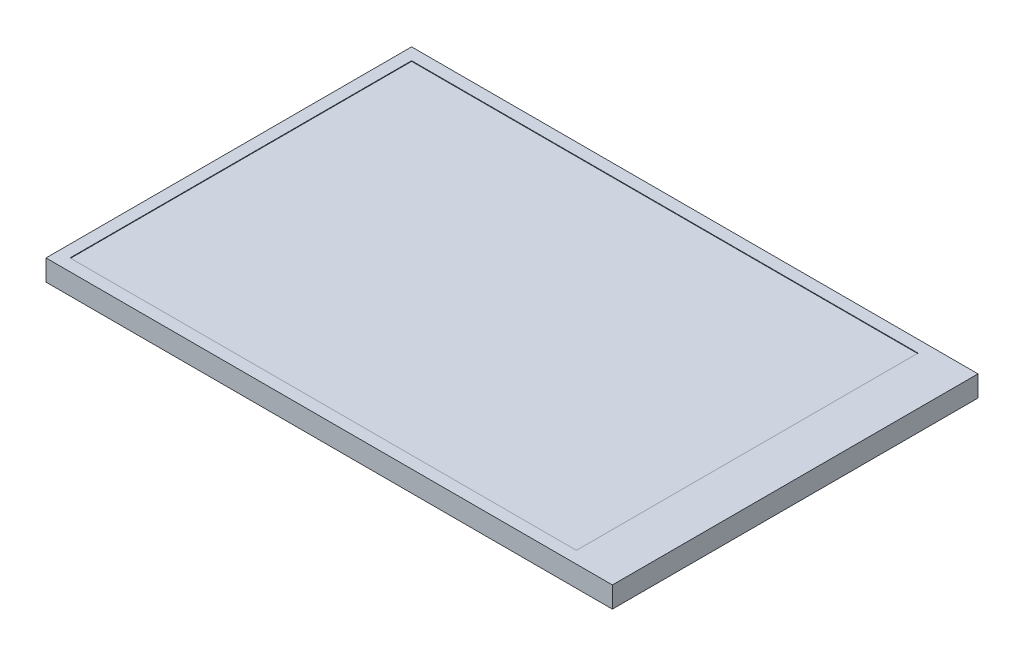
ISO-10303-21;
HEADER;
FILE_DESCRIPTION(('STEP AP214'),'2;1');
FILE_NAME('part.step','',(''),(''),'','','');
FILE_SCHEMA(('AUTOMOTIVE_DESIGN { 1 0 10303 214 1 1 1 1 }'));
ENDSEC;
DATA;
#1=APPLICATION_CONTEXT('core data for automotive mechanical design processes');
#2=APPLICATION_PROTOCOL_DEFINITION('international standard','automotive_design',2000,#1);
#3=PRODUCT_CONTEXT('',#1,'mechanical');
#4=PRODUCT('Part','Part','',(#3));
#5=PRODUCT_RELATED_PRODUCT_CATEGORY('part','',(#4));
#6=PRODUCT_DEFINITION_FORMATION('','',#4);
#7=PRODUCT_DEFINITION_CONTEXT('part definition',#1,'design');
#8=PRODUCT_DEFINITION('design','',#6,#7);
#9=PRODUCT_DEFINITION_SHAPE('','',#8);
#10=(LENGTH_UNIT() NAMED_UNIT(*) SI_UNIT(.MILLI.,.METRE.));
#11=(NAMED_UNIT(*) PLANE_ANGLE_UNIT() SI_UNIT($,.RADIAN.));
#12=(NAMED_UNIT(*) SI_UNIT($,.STERADIAN.) SOLID_ANGLE_UNIT());
#13=UNCERTAINTY_MEASURE_WITH_UNIT(LENGTH_MEASURE(1.E-05),#10,'distance_accuracy_value','');
#14=(GEOMETRIC_REPRESENTATION_CONTEXT(3) GLOBAL_UNCERTAINTY_ASSIGNED_CONTEXT((#13)) GLOBAL_UNIT_ASSIGNED_CONTEXT((#10,
#11,#12)) REPRESENTATION_CONTEXT('',''));
#15=CARTESIAN_POINT('',(0.,0.,0.));
#16=DIRECTION('',(0.,0.,1.));
#17=DIRECTION('',(1.,0.,0.));
#18=AXIS2_PLACEMENT_3D('',#15,#16,#17);
#19=CARTESIAN_POINT('',(47.25,3.5,-30.5));
#20=DIRECTION('',(-1.,0.,0.));
#21=DIRECTION('',(0.,0.,1.));
#22=AXIS2_PLACEMENT_3D('',#19,#20,#21);
#23=PLANE('',#22);
#24=DIRECTION('',(0.,0.,-1.));
#25=VECTOR('',#24,1.);
#26=CARTESIAN_POINT('',(47.25,0.,-30.5));
#27=LINE('',#26,#25);
#28=CARTESIAN_POINT('',(47.25,0.,30.5));
#29=VERTEX_POINT('',#28);
#30=CARTESIAN_POINT('',(47.25,0.,-30.5));
#31=VERTEX_POINT('',#30);
#32=EDGE_CURVE('E140',#29,#31,#27,.T.);
#33=ORIENTED_EDGE('',*,*,#32,.T.);
#34=DIRECTION('',(0.,-1.,0.));
#35=VECTOR('',#34,1.);
#36=CARTESIAN_POINT('',(47.25,3.5,-30.5));
#37=LINE('',#36,#35);
#38=CARTESIAN_POINT('',(47.25,3.5,-30.5));
#39=VERTEX_POINT('',#38);
#40=EDGE_CURVE('E11',#39,#31,#37,.T.);
#41=ORIENTED_EDGE('',*,*,#40,.F.);
#42=DIRECTION('',(0.,0.,-1.));
#43=VECTOR('',#42,1.);
#44=CARTESIAN_POINT('',(47.25,3.5,-30.5));
#45=LINE('',#44,#43);
#46=CARTESIAN_POINT('',(47.25,3.5,30.5));
#47=VERTEX_POINT('',#46);
#48=EDGE_CURVE('E144',#47,#39,#45,.T.);
#49=ORIENTED_EDGE('',*,*,#48,.F.);
#50=DIRECTION('',(0.,-1.,0.));
#51=VECTOR('',#50,1.);
#52=CARTESIAN_POINT('',(47.25,3.5,30.5));
#53=LINE('',#52,#51);
#54=EDGE_CURVE('E150',#47,#29,#53,.T.);
#55=ORIENTED_EDGE('',*,*,#54,.T.);
#56=EDGE_LOOP('',(#33,#41,#49,#55));
#57=FACE_BOUND('',#56,.T.);
#58=ADVANCED_FACE('F32',(#57),#23,.F.);
#59=CARTESIAN_POINT('',(-47.25,3.5,-30.5));
#60=DIRECTION('',(0.,0.,1.));
#61=DIRECTION('',(1.,0.,0.));
#62=AXIS2_PLACEMENT_3D('',#59,#60,#61);
#63=PLANE('',#62);
#64=DIRECTION('',(-1.,0.,0.));
#65=VECTOR('',#64,1.);
#66=CARTESIAN_POINT('',(-47.25,0.,-30.5));
#67=LINE('',#66,#65);
#68=CARTESIAN_POINT('',(-47.25,0.,-30.5));
#69=VERTEX_POINT('',#68);
#70=EDGE_CURVE('E153',#31,#69,#67,.T.);
#71=ORIENTED_EDGE('',*,*,#70,.T.);
#72=DIRECTION('',(0.,-1.,0.));
#73=VECTOR('',#72,1.);
#74=CARTESIAN_POINT('',(-47.25,3.5,-30.5));
#75=LINE('',#74,#73);
#76=CARTESIAN_POINT('',(-47.25,3.5,-30.5));
#77=VERTEX_POINT('',#76);
#78=EDGE_CURVE('E39',#77,#69,#75,.T.);
#79=ORIENTED_EDGE('',*,*,#78,.F.);
#80=DIRECTION('',(-1.,0.,0.));
#81=VECTOR('',#80,1.);
#82=CARTESIAN_POINT('',(-47.25,3.5,-30.5));
#83=LINE('',#82,#81);
#84=EDGE_CURVE('E83',#39,#77,#83,.T.);
#85=ORIENTED_EDGE('',*,*,#84,.F.);
#86=ORIENTED_EDGE('',*,*,#40,.T.);
#87=EDGE_LOOP('',(#71,#79,#85,#86));
#88=FACE_BOUND('',#87,.T.);
#89=ADVANCED_FACE('F182',(#88),#63,.F.);
#90=CARTESIAN_POINT('',(-47.25,3.5,-30.5));
#91=DIRECTION('',(1.,0.,0.));
#92=DIRECTION('',(0.,0.,-1.));
#93=AXIS2_PLACEMENT_3D('',#90,#91,#92);
#94=PLANE('',#93);
#95=DIRECTION('',(0.,0.,1.));
#96=VECTOR('',#95,1.);
#97=CARTESIAN_POINT('',(-47.25,0.,-30.5));
#98=LINE('',#97,#96);
#99=CARTESIAN_POINT('',(-47.25,0.,30.5));
#100=VERTEX_POINT('',#99);
#101=EDGE_CURVE('E155',#69,#100,#98,.T.);
#102=ORIENTED_EDGE('',*,*,#101,.T.);
#103=DIRECTION('',(0.,-1.,0.));
#104=VECTOR('',#103,1.);
#105=CARTESIAN_POINT('',(-47.25,3.5,30.5));
#106=LINE('',#105,#104);
#107=CARTESIAN_POINT('',(-47.25,3.5,30.5));
#108=VERTEX_POINT('',#107);
#109=EDGE_CURVE('E159',#108,#100,#106,.T.);
#110=ORIENTED_EDGE('',*,*,#109,.F.);
#111=DIRECTION('',(0.,0.,1.));
#112=VECTOR('',#111,1.);
#113=CARTESIAN_POINT('',(-47.25,3.5,-30.5));
#114=LINE('',#113,#112);
#115=EDGE_CURVE('E147',#77,#108,#114,.T.);
#116=ORIENTED_EDGE('',*,*,#115,.F.);
#117=ORIENTED_EDGE('',*,*,#78,.T.);
#118=EDGE_LOOP('',(#102,#110,#116,#117));
#119=FACE_BOUND('',#118,.T.);
#120=ADVANCED_FACE('F164',(#119),#94,.F.);
#121=CARTESIAN_POINT('',(-47.25,3.5,30.5));
#122=DIRECTION('',(0.,0.,-1.));
#123=DIRECTION('',(-1.,0.,0.));
#124=AXIS2_PLACEMENT_3D('',#121,#122,#123);
#125=PLANE('',#124);
#126=DIRECTION('',(1.,0.,0.));
#127=VECTOR('',#126,1.);
#128=CARTESIAN_POINT('',(-47.25,0.,30.5));
#129=LINE('',#128,#127);
#130=EDGE_CURVE('E76',#100,#29,#129,.T.);
#131=ORIENTED_EDGE('',*,*,#130,.T.);
#132=ORIENTED_EDGE('',*,*,#54,.F.);
#133=DIRECTION('',(1.,0.,0.));
#134=VECTOR('',#133,1.);
#135=CARTESIAN_POINT('',(-47.25,3.5,30.5));
#136=LINE('',#135,#134);
#137=EDGE_CURVE('E55',#108,#47,#136,.T.);
#138=ORIENTED_EDGE('',*,*,#137,.F.);
#139=ORIENTED_EDGE('',*,*,#109,.T.);
#140=EDGE_LOOP('',(#131,#132,#138,#139));
#141=FACE_BOUND('',#140,.T.);
#142=ADVANCED_FACE('F172',(#141),#125,.F.);
#143=CARTESIAN_POINT('',(0.,3.5,0.));
#144=DIRECTION('',(0.,1.,0.));
#145=DIRECTION('',(0.,0.,1.));
#146=AXIS2_PLACEMENT_3D('',#143,#144,#145);
#147=PLANE('',#146);
#148=DIRECTION('',(0.,0.,-1.));
#149=VECTOR('',#148,1.);
#150=CARTESIAN_POINT('',(39.25,3.5,-28.5));
#151=LINE('',#150,#149);
#152=CARTESIAN_POINT('',(39.25,3.5,28.5));
#153=VERTEX_POINT('',#152);
#154=CARTESIAN_POINT('',(39.25,3.5,-28.5));
#155=VERTEX_POINT('',#154);
#156=EDGE_CURVE('E46',#153,#155,#151,.T.);
#157=ORIENTED_EDGE('',*,*,#156,.F.);
#158=DIRECTION('',(1.,0.,0.));
#159=VECTOR('',#158,1.);
#160=CARTESIAN_POINT('',(-45.25,3.5,28.5));
#161=LINE('',#160,#159);
#162=CARTESIAN_POINT('',(-45.25,3.5,28.5));
#163=VERTEX_POINT('',#162);
#164=EDGE_CURVE('E125',#163,#153,#161,.T.);
#165=ORIENTED_EDGE('',*,*,#164,.F.);
#166=DIRECTION('',(0.,0.,1.));
#167=VECTOR('',#166,1.);
#168=CARTESIAN_POINT('',(-45.25,3.5,-28.5));
#169=LINE('',#168,#167);
#170=CARTESIAN_POINT('',(-45.25,3.5,-28.5));
#171=VERTEX_POINT('',#170);
#172=EDGE_CURVE('E128',#171,#163,#169,.T.);
#173=ORIENTED_EDGE('',*,*,#172,.F.);
#174=DIRECTION('',(-1.,0.,0.));
#175=VECTOR('',#174,1.);
#176=CARTESIAN_POINT('',(-45.25,3.5,-28.5));
#177=LINE('',#176,#175);
#178=EDGE_CURVE('E134',#155,#171,#177,.T.);
#179=ORIENTED_EDGE('',*,*,#178,.F.);
#180=EDGE_LOOP('',(#157,#165,#173,#179));
#181=FACE_BOUND('',#180,.T.);
#182=ORIENTED_EDGE('',*,*,#48,.T.);
#183=ORIENTED_EDGE('',*,*,#84,.T.);
#184=ORIENTED_EDGE('',*,*,#115,.T.);
#185=ORIENTED_EDGE('',*,*,#137,.T.);
#186=EDGE_LOOP('',(#182,#183,#184,#185));
#187=FACE_BOUND('',#186,.T.);
#188=ADVANCED_FACE('F174',(#181,#187),#147,.T.);
#189=CARTESIAN_POINT('',(0.,0.,0.));
#190=DIRECTION('',(0.,1.,0.));
#191=DIRECTION('',(0.,0.,1.));
#192=AXIS2_PLACEMENT_3D('',#189,#190,#191);
#193=PLANE('',#192);
#194=ORIENTED_EDGE('',*,*,#32,.F.);
#195=ORIENTED_EDGE('',*,*,#130,.F.);
#196=ORIENTED_EDGE('',*,*,#101,.F.);
#197=ORIENTED_EDGE('',*,*,#70,.F.);
#198=EDGE_LOOP('',(#194,#195,#196,#197));
#199=FACE_BOUND('',#198,.T.);
#200=ADVANCED_FACE('F168',(#199),#193,.F.);
#201=CARTESIAN_POINT('',(39.25,3.4,-28.5));
#202=DIRECTION('',(1.,0.,0.));
#203=DIRECTION('',(0.,0.,-1.));
#204=AXIS2_PLACEMENT_3D('',#201,#202,#203);
#205=PLANE('',#204);
#206=ORIENTED_EDGE('',*,*,#156,.T.);
#207=DIRECTION('',(0.,1.,0.));
#208=VECTOR('',#207,1.);
#209=CARTESIAN_POINT('',(39.25,3.4,-28.5));
#210=LINE('',#209,#208);
#211=CARTESIAN_POINT('',(39.25,3.4,-28.5));
#212=VERTEX_POINT('',#211);
#213=EDGE_CURVE('E103',#212,#155,#210,.T.);
#214=ORIENTED_EDGE('',*,*,#213,.F.);
#215=DIRECTION('',(0.,0.,-1.));
#216=VECTOR('',#215,1.);
#217=CARTESIAN_POINT('',(39.25,3.4,-28.5));
#218=LINE('',#217,#216);
#219=CARTESIAN_POINT('',(39.25,3.4,28.5));
#220=VERTEX_POINT('',#219);
#221=EDGE_CURVE('E107',#220,#212,#218,.T.);
#222=ORIENTED_EDGE('',*,*,#221,.F.);
#223=DIRECTION('',(0.,1.,0.));
#224=VECTOR('',#223,1.);
#225=CARTESIAN_POINT('',(39.25,3.4,28.5));
#226=LINE('',#225,#224);
#227=EDGE_CURVE('E138',#220,#153,#226,.T.);
#228=ORIENTED_EDGE('',*,*,#227,.T.);
#229=EDGE_LOOP('',(#206,#214,#222,#228));
#230=FACE_BOUND('',#229,.T.);
#231=ADVANCED_FACE('F105',(#230),#205,.F.);
#232=CARTESIAN_POINT('',(-45.25,3.4,28.5));
#233=DIRECTION('',(0.,0.,1.));
#234=DIRECTION('',(1.,0.,0.));
#235=AXIS2_PLACEMENT_3D('',#232,#233,#234);
#236=PLANE('',#235);
#237=ORIENTED_EDGE('',*,*,#164,.T.);
#238=ORIENTED_EDGE('',*,*,#227,.F.);
#239=DIRECTION('',(1.,0.,0.));
#240=VECTOR('',#239,1.);
#241=CARTESIAN_POINT('',(-45.25,3.4,28.5));
#242=LINE('',#241,#240);
#243=CARTESIAN_POINT('',(-45.25,3.4,28.5));
#244=VERTEX_POINT('',#243);
#245=EDGE_CURVE('E113',#244,#220,#242,.T.);
#246=ORIENTED_EDGE('',*,*,#245,.F.);
#247=DIRECTION('',(0.,1.,0.));
#248=VECTOR('',#247,1.);
#249=CARTESIAN_POINT('',(-45.25,3.4,28.5));
#250=LINE('',#249,#248);
#251=EDGE_CURVE('E141',#244,#163,#250,.T.);
#252=ORIENTED_EDGE('',*,*,#251,.T.);
#253=EDGE_LOOP('',(#237,#238,#246,#252));
#254=FACE_BOUND('',#253,.T.);
#255=ADVANCED_FACE('F221',(#254),#236,.F.);
#256=CARTESIAN_POINT('',(-45.25,3.4,-28.5));
#257=DIRECTION('',(-1.,0.,0.));
#258=DIRECTION('',(0.,0.,1.));
#259=AXIS2_PLACEMENT_3D('',#256,#257,#258);
#260=PLANE('',#259);
#261=ORIENTED_EDGE('',*,*,#172,.T.);
#262=ORIENTED_EDGE('',*,*,#251,.F.);
#263=DIRECTION('',(0.,0.,1.));
#264=VECTOR('',#263,1.);
#265=CARTESIAN_POINT('',(-45.25,3.4,-28.5));
#266=LINE('',#265,#264);
#267=CARTESIAN_POINT('',(-45.25,3.4,-28.5));
#268=VERTEX_POINT('',#267);
#269=EDGE_CURVE('E121',#268,#244,#266,.T.);
#270=ORIENTED_EDGE('',*,*,#269,.F.);
#271=DIRECTION('',(0.,1.,0.));
#272=VECTOR('',#271,1.);
#273=CARTESIAN_POINT('',(-45.25,3.4,-28.5));
#274=LINE('',#273,#272);
#275=EDGE_CURVE('E112',#268,#171,#274,.T.);
#276=ORIENTED_EDGE('',*,*,#275,.T.);
#277=EDGE_LOOP('',(#261,#262,#270,#276));
#278=FACE_BOUND('',#277,.T.);
#279=ADVANCED_FACE('F230',(#278),#260,.F.);
#280=CARTESIAN_POINT('',(-45.25,3.4,-28.5));
#281=DIRECTION('',(0.,0.,-1.));
#282=DIRECTION('',(-1.,0.,0.));
#283=AXIS2_PLACEMENT_3D('',#280,#281,#282);
#284=PLANE('',#283);
#285=ORIENTED_EDGE('',*,*,#178,.T.);
#286=ORIENTED_EDGE('',*,*,#275,.F.);
#287=DIRECTION('',(-1.,0.,0.));
#288=VECTOR('',#287,1.);
#289=CARTESIAN_POINT('',(-45.25,3.4,-28.5));
#290=LINE('',#289,#288);
#291=EDGE_CURVE('E116',#212,#268,#290,.T.);
#292=ORIENTED_EDGE('',*,*,#291,.F.);
#293=ORIENTED_EDGE('',*,*,#213,.T.);
#294=EDGE_LOOP('',(#285,#286,#292,#293));
#295=FACE_BOUND('',#294,.T.);
#296=ADVANCED_FACE('F117',(#295),#284,.F.);
#297=CARTESIAN_POINT('',(0.,3.4,0.));
#298=DIRECTION('',(0.,1.,0.));
#299=DIRECTION('',(0.,0.,1.));
#300=AXIS2_PLACEMENT_3D('',#297,#298,#299);
#301=PLANE('',#300);
#302=ORIENTED_EDGE('',*,*,#221,.T.);
#303=ORIENTED_EDGE('',*,*,#291,.T.);
#304=ORIENTED_EDGE('',*,*,#269,.T.);
#305=ORIENTED_EDGE('',*,*,#245,.T.);
#306=EDGE_LOOP('',(#302,#303,#304,#305));
#307=FACE_BOUND('',#306,.T.);
#308=ADVANCED_FACE('F123',(#307),#301,.T.);
#309=CLOSED_SHELL('',(#58,#89,#120,#142,#188,#200,#231,#255,#279,#296,#308));
#310=MANIFOLD_SOLID_BREP('B2',#309);
#311=ADVANCED_BREP_SHAPE_REPRESENTATION('',(#18,#310),#14);
#312=SHAPE_DEFINITION_REPRESENTATION(#9,#311);
ENDSEC;
END-ISO-10303-21;
